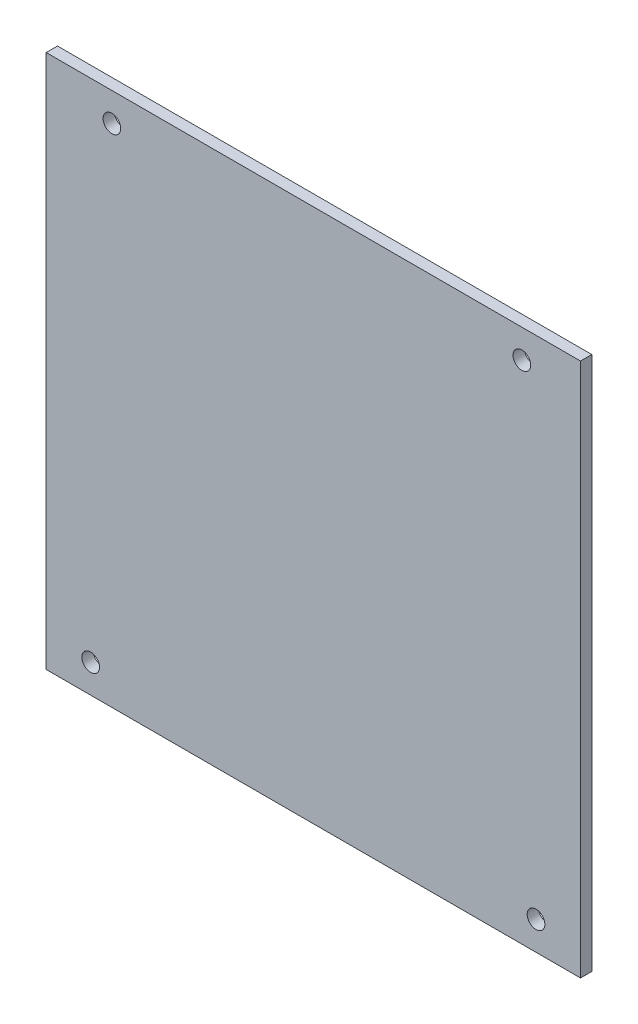
ISO-10303-21;
HEADER;
FILE_DESCRIPTION(('STEP AP214'),'2;1');
FILE_NAME('part.step','',(''),(''),'','','');
FILE_SCHEMA(('AUTOMOTIVE_DESIGN { 1 0 10303 214 1 1 1 1 }'));
ENDSEC;
DATA;
#1=APPLICATION_CONTEXT('core data for automotive mechanical design processes');
#2=APPLICATION_PROTOCOL_DEFINITION('international standard','automotive_design',2000,#1);
#3=PRODUCT_CONTEXT('',#1,'mechanical');
#4=PRODUCT('Part','Part','',(#3));
#5=PRODUCT_RELATED_PRODUCT_CATEGORY('part','',(#4));
#6=PRODUCT_DEFINITION_FORMATION('','',#4);
#7=PRODUCT_DEFINITION_CONTEXT('part definition',#1,'design');
#8=PRODUCT_DEFINITION('design','',#6,#7);
#9=PRODUCT_DEFINITION_SHAPE('','',#8);
#10=(LENGTH_UNIT() NAMED_UNIT(*) SI_UNIT(.MILLI.,.METRE.));
#11=(NAMED_UNIT(*) PLANE_ANGLE_UNIT() SI_UNIT($,.RADIAN.));
#12=(NAMED_UNIT(*) SI_UNIT($,.STERADIAN.) SOLID_ANGLE_UNIT());
#13=UNCERTAINTY_MEASURE_WITH_UNIT(LENGTH_MEASURE(1.E-05),#10,'distance_accuracy_value','');
#14=(GEOMETRIC_REPRESENTATION_CONTEXT(3) GLOBAL_UNCERTAINTY_ASSIGNED_CONTEXT((#13)) GLOBAL_UNIT_ASSIGNED_CONTEXT((#10,
#11,#12)) REPRESENTATION_CONTEXT('',''));
#15=CARTESIAN_POINT('',(0.,0.,0.));
#16=DIRECTION('',(0.,0.,1.));
#17=DIRECTION('',(1.,0.,0.));
#18=AXIS2_PLACEMENT_3D('',#15,#16,#17);
#19=CARTESIAN_POINT('',(0.,-48.,1.016));
#20=DIRECTION('',(0.,1.,0.));
#21=DIRECTION('',(0.,0.,1.));
#22=AXIS2_PLACEMENT_3D('',#19,#20,#21);
#23=PLANE('',#22);
#24=DIRECTION('',(1.,0.,0.));
#25=VECTOR('',#24,1.);
#26=CARTESIAN_POINT('',(0.,-48.,-1.016));
#27=LINE('',#26,#25);
#28=CARTESIAN_POINT('',(-48.,-48.,-1.016));
#29=VERTEX_POINT('',#28);
#30=CARTESIAN_POINT('',(48.,-48.,-1.016));
#31=VERTEX_POINT('',#30);
#32=EDGE_CURVE('E115',#29,#31,#27,.T.);
#33=ORIENTED_EDGE('',*,*,#32,.T.);
#34=DIRECTION('',(0.,0.,-1.));
#35=VECTOR('',#34,1.);
#36=CARTESIAN_POINT('',(48.,-48.,1.016));
#37=LINE('',#36,#35);
#38=CARTESIAN_POINT('',(48.,-48.,1.016));
#39=VERTEX_POINT('',#38);
#40=EDGE_CURVE('E11',#39,#31,#37,.T.);
#41=ORIENTED_EDGE('',*,*,#40,.F.);
#42=DIRECTION('',(1.,0.,0.));
#43=VECTOR('',#42,1.);
#44=CARTESIAN_POINT('',(0.,-48.,1.016));
#45=LINE('',#44,#43);
#46=CARTESIAN_POINT('',(-48.,-48.,1.016));
#47=VERTEX_POINT('',#46);
#48=EDGE_CURVE('E89',#47,#39,#45,.T.);
#49=ORIENTED_EDGE('',*,*,#48,.F.);
#50=DIRECTION('',(0.,0.,-1.));
#51=VECTOR('',#50,1.);
#52=CARTESIAN_POINT('',(-48.,-48.,1.016));
#53=LINE('',#52,#51);
#54=EDGE_CURVE('E55',#47,#29,#53,.T.);
#55=ORIENTED_EDGE('',*,*,#54,.T.);
#56=EDGE_LOOP('',(#33,#41,#49,#55));
#57=FACE_BOUND('',#56,.T.);
#58=ADVANCED_FACE('F39',(#57),#23,.F.);
#59=CARTESIAN_POINT('',(48.,0.,1.016));
#60=DIRECTION('',(-1.,0.,0.));
#61=DIRECTION('',(0.,0.,1.));
#62=AXIS2_PLACEMENT_3D('',#59,#60,#61);
#63=PLANE('',#62);
#64=DIRECTION('',(0.,1.,0.));
#65=VECTOR('',#64,1.);
#66=CARTESIAN_POINT('',(48.,0.,-1.016));
#67=LINE('',#66,#65);
#68=CARTESIAN_POINT('',(48.,48.,-1.016));
#69=VERTEX_POINT('',#68);
#70=EDGE_CURVE('E94',#31,#69,#67,.T.);
#71=ORIENTED_EDGE('',*,*,#70,.T.);
#72=DIRECTION('',(0.,0.,-1.));
#73=VECTOR('',#72,1.);
#74=CARTESIAN_POINT('',(48.,48.,1.016));
#75=LINE('',#74,#73);
#76=CARTESIAN_POINT('',(48.,48.,1.016));
#77=VERTEX_POINT('',#76);
#78=EDGE_CURVE('E47',#77,#69,#75,.T.);
#79=ORIENTED_EDGE('',*,*,#78,.F.);
#80=DIRECTION('',(0.,1.,0.));
#81=VECTOR('',#80,1.);
#82=CARTESIAN_POINT('',(48.,0.,1.016));
#83=LINE('',#82,#81);
#84=EDGE_CURVE('E80',#39,#77,#83,.T.);
#85=ORIENTED_EDGE('',*,*,#84,.F.);
#86=ORIENTED_EDGE('',*,*,#40,.T.);
#87=EDGE_LOOP('',(#71,#79,#85,#86));
#88=FACE_BOUND('',#87,.T.);
#89=ADVANCED_FACE('F93',(#88),#63,.F.);
#90=CARTESIAN_POINT('',(0.,48.,1.016));
#91=DIRECTION('',(0.,1.,0.));
#92=DIRECTION('',(0.,0.,1.));
#93=AXIS2_PLACEMENT_3D('',#90,#91,#92);
#94=PLANE('',#93);
#95=DIRECTION('',(1.,0.,0.));
#96=VECTOR('',#95,1.);
#97=CARTESIAN_POINT('',(0.,48.,-1.016));
#98=LINE('',#97,#96);
#99=CARTESIAN_POINT('',(-48.,48.,-1.016));
#100=VERTEX_POINT('',#99);
#101=EDGE_CURVE('E118',#100,#69,#98,.T.);
#102=ORIENTED_EDGE('',*,*,#101,.F.);
#103=DIRECTION('',(0.,0.,-1.));
#104=VECTOR('',#103,1.);
#105=CARTESIAN_POINT('',(-48.,48.,1.016));
#106=LINE('',#105,#104);
#107=CARTESIAN_POINT('',(-48.,48.,1.016));
#108=VERTEX_POINT('',#107);
#109=EDGE_CURVE('E69',#108,#100,#106,.T.);
#110=ORIENTED_EDGE('',*,*,#109,.F.);
#111=DIRECTION('',(1.,0.,0.));
#112=VECTOR('',#111,1.);
#113=CARTESIAN_POINT('',(0.,48.,1.016));
#114=LINE('',#113,#112);
#115=EDGE_CURVE('E88',#108,#77,#114,.T.);
#116=ORIENTED_EDGE('',*,*,#115,.T.);
#117=ORIENTED_EDGE('',*,*,#78,.T.);
#118=EDGE_LOOP('',(#102,#110,#116,#117));
#119=FACE_BOUND('',#118,.T.);
#120=ADVANCED_FACE('F97',(#119),#94,.T.);
#121=CARTESIAN_POINT('',(37.465,42.865,1.016));
#122=DIRECTION('',(0.,0.,-1.));
#123=DIRECTION('',(-1.,0.,0.));
#124=AXIS2_PLACEMENT_3D('',#121,#122,#123);
#125=CYLINDRICAL_SURFACE('',#124,1.59);
#126=CARTESIAN_POINT('',(37.465,42.865,1.016));
#127=DIRECTION('',(0.,0.,1.));
#128=DIRECTION('',(1.,0.,0.));
#129=AXIS2_PLACEMENT_3D('',#126,#127,#128);
#130=CIRCLE('',#129,1.59);
#131=CARTESIAN_POINT('',(39.055,42.865,1.016));
#132=VERTEX_POINT('',#131);
#133=EDGE_CURVE('E109',#132,#132,#130,.T.);
#134=ORIENTED_EDGE('',*,*,#133,.T.);
#135=EDGE_LOOP('',(#134));
#136=FACE_BOUND('',#135,.T.);
#137=CARTESIAN_POINT('',(37.465,42.865,-1.016));
#138=DIRECTION('',(0.,0.,1.));
#139=DIRECTION('',(1.,0.,0.));
#140=AXIS2_PLACEMENT_3D('',#137,#138,#139);
#141=CIRCLE('',#140,1.59);
#142=CARTESIAN_POINT('',(39.055,42.865,-1.016));
#143=VERTEX_POINT('',#142);
#144=EDGE_CURVE('E129',#143,#143,#141,.T.);
#145=ORIENTED_EDGE('',*,*,#144,.F.);
#146=EDGE_LOOP('',(#145));
#147=FACE_BOUND('',#146,.T.);
#148=ADVANCED_FACE('F167',(#136,#147),#125,.F.);
#149=CARTESIAN_POINT('',(-36.195,42.865,1.016));
#150=DIRECTION('',(0.,0.,-1.));
#151=DIRECTION('',(-1.,0.,0.));
#152=AXIS2_PLACEMENT_3D('',#149,#150,#151);
#153=CYLINDRICAL_SURFACE('',#152,1.59);
#154=CARTESIAN_POINT('',(-36.195,42.865,1.016));
#155=DIRECTION('',(0.,0.,1.));
#156=DIRECTION('',(1.,0.,0.));
#157=AXIS2_PLACEMENT_3D('',#154,#155,#156);
#158=CIRCLE('',#157,1.59);
#159=CARTESIAN_POINT('',(-34.605,42.865,1.016));
#160=VERTEX_POINT('',#159);
#161=EDGE_CURVE('E106',#160,#160,#158,.T.);
#162=ORIENTED_EDGE('',*,*,#161,.T.);
#163=EDGE_LOOP('',(#162));
#164=FACE_BOUND('',#163,.T.);
#165=CARTESIAN_POINT('',(-36.195,42.865,-1.016));
#166=DIRECTION('',(0.,0.,1.));
#167=DIRECTION('',(1.,0.,0.));
#168=AXIS2_PLACEMENT_3D('',#165,#166,#167);
#169=CIRCLE('',#168,1.59);
#170=CARTESIAN_POINT('',(-34.605,42.865,-1.016));
#171=VERTEX_POINT('',#170);
#172=EDGE_CURVE('E126',#171,#171,#169,.T.);
#173=ORIENTED_EDGE('',*,*,#172,.F.);
#174=EDGE_LOOP('',(#173));
#175=FACE_BOUND('',#174,.T.);
#176=ADVANCED_FACE('F169',(#164,#175),#153,.F.);
#177=CARTESIAN_POINT('',(-40.005,-42.865,1.016));
#178=DIRECTION('',(0.,0.,-1.));
#179=DIRECTION('',(-1.,0.,0.));
#180=AXIS2_PLACEMENT_3D('',#177,#178,#179);
#181=CYLINDRICAL_SURFACE('',#180,1.59);
#182=CARTESIAN_POINT('',(-40.005,-42.865,1.016));
#183=DIRECTION('',(0.,0.,1.));
#184=DIRECTION('',(1.,0.,0.));
#185=AXIS2_PLACEMENT_3D('',#182,#183,#184);
#186=CIRCLE('',#185,1.59);
#187=CARTESIAN_POINT('',(-38.415,-42.865,1.016));
#188=VERTEX_POINT('',#187);
#189=EDGE_CURVE('E100',#188,#188,#186,.T.);
#190=ORIENTED_EDGE('',*,*,#189,.T.);
#191=EDGE_LOOP('',(#190));
#192=FACE_BOUND('',#191,.T.);
#193=CARTESIAN_POINT('',(-40.005,-42.865,-1.016));
#194=DIRECTION('',(0.,0.,1.));
#195=DIRECTION('',(1.,0.,0.));
#196=AXIS2_PLACEMENT_3D('',#193,#194,#195);
#197=CIRCLE('',#196,1.59);
#198=CARTESIAN_POINT('',(-38.415,-42.865,-1.016));
#199=VERTEX_POINT('',#198);
#200=EDGE_CURVE('E123',#199,#199,#197,.T.);
#201=ORIENTED_EDGE('',*,*,#200,.F.);
#202=EDGE_LOOP('',(#201));
#203=FACE_BOUND('',#202,.T.);
#204=ADVANCED_FACE('F150',(#192,#203),#181,.F.);
#205=CARTESIAN_POINT('',(-48.,0.,1.016));
#206=DIRECTION('',(-1.,0.,0.));
#207=DIRECTION('',(0.,0.,1.));
#208=AXIS2_PLACEMENT_3D('',#205,#206,#207);
#209=PLANE('',#208);
#210=DIRECTION('',(0.,1.,0.));
#211=VECTOR('',#210,1.);
#212=CARTESIAN_POINT('',(-48.,0.,-1.016));
#213=LINE('',#212,#211);
#214=EDGE_CURVE('E120',#29,#100,#213,.T.);
#215=ORIENTED_EDGE('',*,*,#214,.F.);
#216=ORIENTED_EDGE('',*,*,#54,.F.);
#217=DIRECTION('',(0.,1.,0.));
#218=VECTOR('',#217,1.);
#219=CARTESIAN_POINT('',(-48.,0.,1.016));
#220=LINE('',#219,#218);
#221=EDGE_CURVE('E98',#47,#108,#220,.T.);
#222=ORIENTED_EDGE('',*,*,#221,.T.);
#223=ORIENTED_EDGE('',*,*,#109,.T.);
#224=EDGE_LOOP('',(#215,#216,#222,#223));
#225=FACE_BOUND('',#224,.T.);
#226=ADVANCED_FACE('F142',(#225),#209,.T.);
#227=CARTESIAN_POINT('',(40.005,-42.865,1.016));
#228=DIRECTION('',(0.,0.,-1.));
#229=DIRECTION('',(-1.,0.,0.));
#230=AXIS2_PLACEMENT_3D('',#227,#228,#229);
#231=CYLINDRICAL_SURFACE('',#230,1.59);
#232=CARTESIAN_POINT('',(40.005,-42.865,1.016));
#233=DIRECTION('',(0.,0.,1.));
#234=DIRECTION('',(1.,0.,0.));
#235=AXIS2_PLACEMENT_3D('',#232,#233,#234);
#236=CIRCLE('',#235,1.59);
#237=CARTESIAN_POINT('',(41.595,-42.865,1.016));
#238=VERTEX_POINT('',#237);
#239=EDGE_CURVE('E112',#238,#238,#236,.T.);
#240=ORIENTED_EDGE('',*,*,#239,.T.);
#241=EDGE_LOOP('',(#240));
#242=FACE_BOUND('',#241,.T.);
#243=CARTESIAN_POINT('',(40.005,-42.865,-1.016));
#244=DIRECTION('',(0.,0.,1.));
#245=DIRECTION('',(1.,0.,0.));
#246=AXIS2_PLACEMENT_3D('',#243,#244,#245);
#247=CIRCLE('',#246,1.59);
#248=CARTESIAN_POINT('',(41.595,-42.865,-1.016));
#249=VERTEX_POINT('',#248);
#250=EDGE_CURVE('E132',#249,#249,#247,.T.);
#251=ORIENTED_EDGE('',*,*,#250,.F.);
#252=EDGE_LOOP('',(#251));
#253=FACE_BOUND('',#252,.T.);
#254=ADVANCED_FACE('F140',(#242,#253),#231,.F.);
#255=CARTESIAN_POINT('',(0.,0.,1.016));
#256=DIRECTION('',(0.,0.,1.));
#257=DIRECTION('',(1.,0.,0.));
#258=AXIS2_PLACEMENT_3D('',#255,#256,#257);
#259=PLANE('',#258);
#260=ORIENTED_EDGE('',*,*,#48,.T.);
#261=ORIENTED_EDGE('',*,*,#84,.T.);
#262=ORIENTED_EDGE('',*,*,#115,.F.);
#263=ORIENTED_EDGE('',*,*,#221,.F.);
#264=EDGE_LOOP('',(#260,#261,#262,#263));
#265=FACE_BOUND('',#264,.T.);
#266=ORIENTED_EDGE('',*,*,#189,.F.);
#267=EDGE_LOOP('',(#266));
#268=FACE_BOUND('',#267,.T.);
#269=ORIENTED_EDGE('',*,*,#161,.F.);
#270=EDGE_LOOP('',(#269));
#271=FACE_BOUND('',#270,.T.);
#272=ORIENTED_EDGE('',*,*,#133,.F.);
#273=EDGE_LOOP('',(#272));
#274=FACE_BOUND('',#273,.T.);
#275=ORIENTED_EDGE('',*,*,#239,.F.);
#276=EDGE_LOOP('',(#275));
#277=FACE_BOUND('',#276,.T.);
#278=ADVANCED_FACE('F84',(#265,#268,#271,#274,#277),#259,.T.);
#279=CARTESIAN_POINT('',(0.,0.,-1.016));
#280=DIRECTION('',(0.,0.,1.));
#281=DIRECTION('',(1.,0.,0.));
#282=AXIS2_PLACEMENT_3D('',#279,#280,#281);
#283=PLANE('',#282);
#284=ORIENTED_EDGE('',*,*,#32,.F.);
#285=ORIENTED_EDGE('',*,*,#214,.T.);
#286=ORIENTED_EDGE('',*,*,#101,.T.);
#287=ORIENTED_EDGE('',*,*,#70,.F.);
#288=EDGE_LOOP('',(#284,#285,#286,#287));
#289=FACE_BOUND('',#288,.T.);
#290=ORIENTED_EDGE('',*,*,#200,.T.);
#291=EDGE_LOOP('',(#290));
#292=FACE_BOUND('',#291,.T.);
#293=ORIENTED_EDGE('',*,*,#172,.T.);
#294=EDGE_LOOP('',(#293));
#295=FACE_BOUND('',#294,.T.);
#296=ORIENTED_EDGE('',*,*,#144,.T.);
#297=EDGE_LOOP('',(#296));
#298=FACE_BOUND('',#297,.T.);
#299=ORIENTED_EDGE('',*,*,#250,.T.);
#300=EDGE_LOOP('',(#299));
#301=FACE_BOUND('',#300,.T.);
#302=ADVANCED_FACE('F138',(#289,#292,#295,#298,#301),#283,.F.);
#303=CLOSED_SHELL('',(#58,#89,#120,#148,#176,#204,#226,#254,#278,#302));
#304=MANIFOLD_SOLID_BREP('B2',#303);
#305=ADVANCED_BREP_SHAPE_REPRESENTATION('',(#18,#304),#14);
#306=SHAPE_DEFINITION_REPRESENTATION(#9,#305);
ENDSEC;
END-ISO-10303-21;
